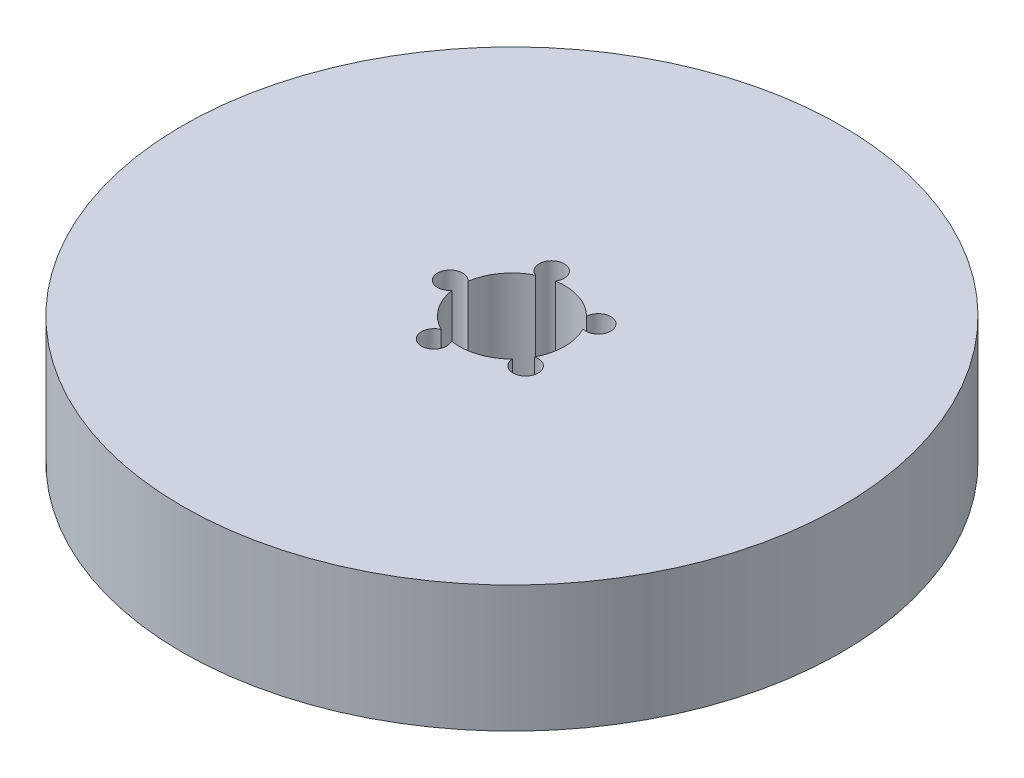
ISO-10303-21;
HEADER;
FILE_DESCRIPTION(('STEP AP214'),'2;1');
FILE_NAME('part.step','',(''),(''),'','','');
FILE_SCHEMA(('AUTOMOTIVE_DESIGN { 1 0 10303 214 1 1 1 1 }'));
ENDSEC;
DATA;
#1=APPLICATION_CONTEXT('core data for automotive mechanical design processes');
#2=APPLICATION_PROTOCOL_DEFINITION('international standard','automotive_design',2000,#1);
#3=PRODUCT_CONTEXT('',#1,'mechanical');
#4=PRODUCT('Part','Part','',(#3));
#5=PRODUCT_RELATED_PRODUCT_CATEGORY('part','',(#4));
#6=PRODUCT_DEFINITION_FORMATION('','',#4);
#7=PRODUCT_DEFINITION_CONTEXT('part definition',#1,'design');
#8=PRODUCT_DEFINITION('design','',#6,#7);
#9=PRODUCT_DEFINITION_SHAPE('','',#8);
#10=(LENGTH_UNIT() NAMED_UNIT(*) SI_UNIT(.MILLI.,.METRE.));
#11=(NAMED_UNIT(*) PLANE_ANGLE_UNIT() SI_UNIT($,.RADIAN.));
#12=(NAMED_UNIT(*) SI_UNIT($,.STERADIAN.) SOLID_ANGLE_UNIT());
#13=UNCERTAINTY_MEASURE_WITH_UNIT(LENGTH_MEASURE(1.E-05),#10,'distance_accuracy_value','');
#14=(GEOMETRIC_REPRESENTATION_CONTEXT(3) GLOBAL_UNCERTAINTY_ASSIGNED_CONTEXT((#13)) GLOBAL_UNIT_ASSIGNED_CONTEXT((#10,
#11,#12)) REPRESENTATION_CONTEXT('',''));
#15=CARTESIAN_POINT('',(0.,0.,0.));
#16=DIRECTION('',(0.,0.,1.));
#17=DIRECTION('',(1.,0.,0.));
#18=AXIS2_PLACEMENT_3D('',#15,#16,#17);
#19=CARTESIAN_POINT('',(0.,24.,0.));
#20=DIRECTION('',(0.,-1.,0.));
#21=DIRECTION('',(0.,0.,-1.));
#22=AXIS2_PLACEMENT_3D('',#19,#20,#21);
#23=CYLINDRICAL_SURFACE('',#22,62.5);
#24=CARTESIAN_POINT('',(0.,24.,0.));
#25=DIRECTION('',(0.,1.,0.));
#26=DIRECTION('',(0.,0.,1.));
#27=AXIS2_PLACEMENT_3D('',#24,#25,#26);
#28=CIRCLE('',#27,62.5);
#29=CARTESIAN_POINT('',(0.,24.,62.5));
#30=VERTEX_POINT('',#29);
#31=EDGE_CURVE('E157',#30,#30,#28,.T.);
#32=ORIENTED_EDGE('',*,*,#31,.F.);
#33=EDGE_LOOP('',(#32));
#34=FACE_BOUND('',#33,.T.);
#35=CARTESIAN_POINT('',(0.,0.,0.));
#36=DIRECTION('',(0.,1.,0.));
#37=DIRECTION('',(0.,0.,1.));
#38=AXIS2_PLACEMENT_3D('',#35,#36,#37);
#39=CIRCLE('',#38,62.5);
#40=CARTESIAN_POINT('',(0.,0.,62.5));
#41=VERTEX_POINT('',#40);
#42=EDGE_CURVE('E150',#41,#41,#39,.T.);
#43=ORIENTED_EDGE('',*,*,#42,.T.);
#44=EDGE_LOOP('',(#43));
#45=FACE_BOUND('',#44,.T.);
#46=ADVANCED_FACE('F39',(#34,#45),#23,.T.);
#47=CARTESIAN_POINT('',(0.,24.,0.));
#48=DIRECTION('',(0.,1.,0.));
#49=DIRECTION('',(0.,0.,1.));
#50=AXIS2_PLACEMENT_3D('',#47,#48,#49);
#51=PLANE('',#50);
#52=CARTESIAN_POINT('',(-3.62283496314992,24.,-11.149939523989));
#53=DIRECTION('',(0.,1.,0.));
#54=DIRECTION('',(-0.95105651629515,0.,0.309016994374958));
#55=AXIS2_PLACEMENT_3D('',#52,#53,#54);
#56=CIRCLE('',#55,2.38429123214421);
#57=CARTESIAN_POINT('',(-1.61168399367624,24.,-9.86926920823055));
#58=VERTEX_POINT('',#57);
#59=CARTESIAN_POINT('',(-4.49713115105617,24.,-8.93173059435853));
#60=VERTEX_POINT('',#59);
#61=EDGE_CURVE('E194',#58,#60,#56,.T.);
#62=ORIENTED_EDGE('',*,*,#61,.F.);
#63=CARTESIAN_POINT('',(0.,24.,0.));
#64=DIRECTION('',(0.,1.,0.));
#65=DIRECTION('',(0.,0.,1.));
#66=AXIS2_PLACEMENT_3D('',#63,#64,#65);
#67=CIRCLE('',#66,10.);
#68=CARTESIAN_POINT('',(7.10489063194816,24.,-7.03708242868131));
#69=VERTEX_POINT('',#68);
#70=EDGE_CURVE('E147',#69,#58,#67,.T.);
#71=ORIENTED_EDGE('',*,*,#70,.F.);
#72=CARTESIAN_POINT('',(9.48470506915758,24.,-6.89104159833114));
#73=DIRECTION('',(0.,1.,0.));
#74=DIRECTION('',(-0.58778525229248,0.,-0.809016994374942));
#75=AXIS2_PLACEMENT_3D('',#72,#73,#74);
#76=CIRCLE('',#75,2.38429123214421);
#77=CARTESIAN_POINT('',(8.88819504795075,24.,-4.58257447179899));
#78=VERTEX_POINT('',#77);
#79=EDGE_CURVE('E254',#78,#69,#76,.T.);
#80=ORIENTED_EDGE('',*,*,#79,.F.);
#81=CARTESIAN_POINT('',(8.88819504795081,24.,4.58257447179886));
#82=VERTEX_POINT('',#81);
#83=EDGE_CURVE('E144',#82,#78,#67,.T.);
#84=ORIENTED_EDGE('',*,*,#83,.F.);
#85=CARTESIAN_POINT('',(9.48470506915768,24.,6.891041598331));
#86=DIRECTION('',(0.,1.,0.));
#87=DIRECTION('',(0.587785252292469,0.,-0.809016994374951));
#88=AXIS2_PLACEMENT_3D('',#85,#86,#87);
#89=CIRCLE('',#88,2.38429123214421);
#90=CARTESIAN_POINT('',(7.10489063194826,24.,7.03708242868121));
#91=VERTEX_POINT('',#90);
#92=EDGE_CURVE('E141',#91,#82,#89,.T.);
#93=ORIENTED_EDGE('',*,*,#92,.F.);
#94=CARTESIAN_POINT('',(-1.61168399367611,24.,9.86926920823058));
#95=VERTEX_POINT('',#94);
#96=EDGE_CURVE('E134',#95,#91,#67,.T.);
#97=ORIENTED_EDGE('',*,*,#96,.F.);
#98=CARTESIAN_POINT('',(-3.62283496314976,24.,11.1499395239891));
#99=DIRECTION('',(0.,1.,0.));
#100=DIRECTION('',(0.951056516295155,0.,0.309016994374945));
#101=AXIS2_PLACEMENT_3D('',#98,#99,#100);
#102=CIRCLE('',#101,2.38429123214421);
#103=CARTESIAN_POINT('',(-4.49713115105604,24.,8.9317305943586));
#104=VERTEX_POINT('',#103);
#105=EDGE_CURVE('E111',#104,#95,#102,.T.);
#106=ORIENTED_EDGE('',*,*,#105,.F.);
#107=CARTESIAN_POINT('',(-9.88427053516681,24.,1.51696934301035));
#108=VERTEX_POINT('',#107);
#109=EDGE_CURVE('E145',#108,#104,#67,.T.);
#110=ORIENTED_EDGE('',*,*,#109,.F.);
#111=CARTESIAN_POINT('',(-11.7237402120157,24.,0.));
#112=DIRECTION('',(0.,1.,0.));
#113=DIRECTION('',(0.,0.,1.));
#114=AXIS2_PLACEMENT_3D('',#111,#112,#113);
#115=CIRCLE('',#114,2.38429123214421);
#116=CARTESIAN_POINT('',(-9.88427053516681,24.,-1.51696934301035));
#117=VERTEX_POINT('',#116);
#118=EDGE_CURVE('E153',#117,#108,#115,.T.);
#119=ORIENTED_EDGE('',*,*,#118,.F.);
#120=EDGE_CURVE('E146',#60,#117,#67,.T.);
#121=ORIENTED_EDGE('',*,*,#120,.F.);
#122=EDGE_LOOP('',(#62,#71,#80,#84,#93,#97,#106,#110,#119,#121));
#123=FACE_BOUND('',#122,.T.);
#124=ORIENTED_EDGE('',*,*,#31,.T.);
#125=EDGE_LOOP('',(#124));
#126=FACE_BOUND('',#125,.T.);
#127=ADVANCED_FACE('F139',(#123,#126),#51,.T.);
#128=CARTESIAN_POINT('',(0.,0.,0.));
#129=DIRECTION('',(0.,1.,0.));
#130=DIRECTION('',(0.,0.,1.));
#131=AXIS2_PLACEMENT_3D('',#128,#129,#130);
#132=PLANE('',#131);
#133=CARTESIAN_POINT('',(0.,0.,0.));
#134=DIRECTION('',(0.,1.,0.));
#135=DIRECTION('',(0.,0.,1.));
#136=AXIS2_PLACEMENT_3D('',#133,#134,#135);
#137=CIRCLE('',#136,10.);
#138=CARTESIAN_POINT('',(0.,0.,10.));
#139=VERTEX_POINT('',#138);
#140=EDGE_CURVE('E154',#139,#139,#137,.T.);
#141=ORIENTED_EDGE('',*,*,#140,.T.);
#142=EDGE_LOOP('',(#141));
#143=FACE_BOUND('',#142,.T.);
#144=ORIENTED_EDGE('',*,*,#42,.F.);
#145=EDGE_LOOP('',(#144));
#146=FACE_BOUND('',#145,.T.);
#147=ADVANCED_FACE('F213',(#143,#146),#132,.F.);
#148=CARTESIAN_POINT('',(0.,24.,0.));
#149=DIRECTION('',(0.,-1.,0.));
#150=DIRECTION('',(0.,0.,-1.));
#151=AXIS2_PLACEMENT_3D('',#148,#149,#150);
#152=CYLINDRICAL_SURFACE('',#151,10.);
#153=DIRECTION('',(0.,1.,0.));
#154=VECTOR('',#153,1.);
#155=CARTESIAN_POINT('',(-1.61168399367624,12.0632224624725,-9.86926920823056));
#156=LINE('',#155,#154);
#157=CARTESIAN_POINT('',(-1.61168399367624,0.126444924944992,-9.86926920823055));
#158=VERTEX_POINT('',#157);
#159=EDGE_CURVE('E11',#158,#58,#156,.T.);
#160=ORIENTED_EDGE('',*,*,#159,.F.);
#161=CARTESIAN_POINT('',(0.,0.126444924944992,0.));
#162=DIRECTION('',(0.,1.,0.));
#163=DIRECTION('',(0.,0.,1.));
#164=AXIS2_PLACEMENT_3D('',#161,#162,#163);
#165=CIRCLE('',#164,10.);
#166=CARTESIAN_POINT('',(-4.49713115105617,0.126444924944992,-8.93173059435853));
#167=VERTEX_POINT('',#166);
#168=EDGE_CURVE('E189',#158,#167,#165,.T.);
#169=ORIENTED_EDGE('',*,*,#168,.T.);
#170=DIRECTION('',(0.,1.,0.));
#171=VECTOR('',#170,1.);
#172=CARTESIAN_POINT('',(-4.49713115105618,12.0632224624725,-8.93173059435853));
#173=LINE('',#172,#171);
#174=EDGE_CURVE('E46',#60,#167,#173,.F.);
#175=ORIENTED_EDGE('',*,*,#174,.F.);
#176=ORIENTED_EDGE('',*,*,#120,.T.);
#177=DIRECTION('',(0.,1.,0.));
#178=VECTOR('',#177,1.);
#179=CARTESIAN_POINT('',(-9.88427053516681,12.0632224624725,-1.51696934301035));
#180=LINE('',#179,#178);
#181=CARTESIAN_POINT('',(-9.88427053516681,0.126444924944992,-1.51696934301035));
#182=VERTEX_POINT('',#181);
#183=EDGE_CURVE('E168',#182,#117,#180,.T.);
#184=ORIENTED_EDGE('',*,*,#183,.F.);
#185=CARTESIAN_POINT('',(0.,0.126444924944992,0.));
#186=DIRECTION('',(0.,1.,0.));
#187=DIRECTION('',(0.,0.,1.));
#188=AXIS2_PLACEMENT_3D('',#185,#186,#187);
#189=CIRCLE('',#188,10.);
#190=CARTESIAN_POINT('',(-9.88427053516681,0.126444924944992,1.51696934301035));
#191=VERTEX_POINT('',#190);
#192=EDGE_CURVE('E165',#182,#191,#189,.T.);
#193=ORIENTED_EDGE('',*,*,#192,.T.);
#194=DIRECTION('',(0.,1.,0.));
#195=VECTOR('',#194,1.);
#196=CARTESIAN_POINT('',(-9.88427053516681,12.0632224624725,1.51696934301035));
#197=LINE('',#196,#195);
#198=EDGE_CURVE('E170',#108,#191,#197,.F.);
#199=ORIENTED_EDGE('',*,*,#198,.F.);
#200=ORIENTED_EDGE('',*,*,#109,.T.);
#201=DIRECTION('',(0.,1.,0.));
#202=VECTOR('',#201,1.);
#203=CARTESIAN_POINT('',(-4.49713115105604,12.0632224624725,8.9317305943586));
#204=LINE('',#203,#202);
#205=CARTESIAN_POINT('',(-4.49713115105604,0.126444924944992,8.9317305943586));
#206=VERTEX_POINT('',#205);
#207=EDGE_CURVE('E121',#206,#104,#204,.T.);
#208=ORIENTED_EDGE('',*,*,#207,.F.);
#209=CARTESIAN_POINT('',(0.,0.126444924944992,0.));
#210=DIRECTION('',(0.,1.,0.));
#211=DIRECTION('',(0.,0.,1.));
#212=AXIS2_PLACEMENT_3D('',#209,#210,#211);
#213=CIRCLE('',#212,10.);
#214=CARTESIAN_POINT('',(-1.61168399367611,0.126444924944992,9.86926920823058));
#215=VERTEX_POINT('',#214);
#216=EDGE_CURVE('E136',#206,#215,#213,.T.);
#217=ORIENTED_EDGE('',*,*,#216,.T.);
#218=DIRECTION('',(0.,1.,0.));
#219=VECTOR('',#218,1.);
#220=CARTESIAN_POINT('',(-1.61168399367611,12.0632224624725,9.86926920823058));
#221=LINE('',#220,#219);
#222=EDGE_CURVE('E117',#95,#215,#221,.F.);
#223=ORIENTED_EDGE('',*,*,#222,.F.);
#224=ORIENTED_EDGE('',*,*,#96,.T.);
#225=DIRECTION('',(0.,1.,0.));
#226=VECTOR('',#225,1.);
#227=CARTESIAN_POINT('',(7.10489063194826,12.0632224624725,7.03708242868122));
#228=LINE('',#227,#226);
#229=CARTESIAN_POINT('',(7.10489063194826,0.126444924944992,7.03708242868121));
#230=VERTEX_POINT('',#229);
#231=EDGE_CURVE('E182',#230,#91,#228,.T.);
#232=ORIENTED_EDGE('',*,*,#231,.F.);
#233=CARTESIAN_POINT('',(0.,0.126444924944992,0.));
#234=DIRECTION('',(0.,1.,0.));
#235=DIRECTION('',(0.,0.,1.));
#236=AXIS2_PLACEMENT_3D('',#233,#234,#235);
#237=CIRCLE('',#236,10.);
#238=CARTESIAN_POINT('',(8.88819504795081,0.126444924944992,4.58257447179886));
#239=VERTEX_POINT('',#238);
#240=EDGE_CURVE('E174',#230,#239,#237,.T.);
#241=ORIENTED_EDGE('',*,*,#240,.T.);
#242=DIRECTION('',(0.,1.,0.));
#243=VECTOR('',#242,1.);
#244=CARTESIAN_POINT('',(8.88819504795082,12.0632224624725,4.58257447179886));
#245=LINE('',#244,#243);
#246=EDGE_CURVE('E177',#82,#239,#245,.F.);
#247=ORIENTED_EDGE('',*,*,#246,.F.);
#248=ORIENTED_EDGE('',*,*,#83,.T.);
#249=DIRECTION('',(0.,1.,0.));
#250=VECTOR('',#249,1.);
#251=CARTESIAN_POINT('',(8.88819504795076,12.0632224624725,-4.58257447179899));
#252=LINE('',#251,#250);
#253=CARTESIAN_POINT('',(8.88819504795075,0.126444924944992,-4.58257447179899));
#254=VERTEX_POINT('',#253);
#255=EDGE_CURVE('E187',#254,#78,#252,.T.);
#256=ORIENTED_EDGE('',*,*,#255,.F.);
#257=CARTESIAN_POINT('',(0.,0.126444924944992,0.));
#258=DIRECTION('',(0.,1.,0.));
#259=DIRECTION('',(0.,0.,1.));
#260=AXIS2_PLACEMENT_3D('',#257,#258,#259);
#261=CIRCLE('',#260,10.);
#262=CARTESIAN_POINT('',(7.10489063194816,0.126444924944992,-7.03708242868131));
#263=VERTEX_POINT('',#262);
#264=EDGE_CURVE('E181',#254,#263,#261,.T.);
#265=ORIENTED_EDGE('',*,*,#264,.T.);
#266=DIRECTION('',(0.,1.,0.));
#267=VECTOR('',#266,1.);
#268=CARTESIAN_POINT('',(7.10489063194816,12.0632224624725,-7.03708242868132));
#269=LINE('',#268,#267);
#270=EDGE_CURVE('E186',#69,#263,#269,.F.);
#271=ORIENTED_EDGE('',*,*,#270,.F.);
#272=ORIENTED_EDGE('',*,*,#70,.T.);
#273=EDGE_LOOP('',(#160,#169,#175,#176,#184,#193,#199,#200,#208,#217,#223,#224,#232,#241,#247,
#248,#256,#265,#271,#272));
#274=FACE_BOUND('',#273,.T.);
#275=ORIENTED_EDGE('',*,*,#140,.F.);
#276=EDGE_LOOP('',(#275));
#277=FACE_BOUND('',#276,.T.);
#278=ADVANCED_FACE('F135',(#274,#277),#152,.F.);
#279=CARTESIAN_POINT('',(-11.7237402120157,0.126444924944992,0.));
#280=DIRECTION('',(0.,1.,0.));
#281=DIRECTION('',(0.,0.,1.));
#282=AXIS2_PLACEMENT_3D('',#279,#280,#281);
#283=CYLINDRICAL_SURFACE('',#282,2.38429123214421);
#284=ORIENTED_EDGE('',*,*,#183,.T.);
#285=ORIENTED_EDGE('',*,*,#118,.T.);
#286=ORIENTED_EDGE('',*,*,#198,.T.);
#287=CARTESIAN_POINT('',(-11.7237402120157,0.126444924944992,0.));
#288=DIRECTION('',(0.,1.,0.));
#289=DIRECTION('',(0.,0.,1.));
#290=AXIS2_PLACEMENT_3D('',#287,#288,#289);
#291=CIRCLE('',#290,2.38429123214421);
#292=EDGE_CURVE('E158',#182,#191,#291,.T.);
#293=ORIENTED_EDGE('',*,*,#292,.F.);
#294=EDGE_LOOP('',(#284,#285,#286,#293));
#295=FACE_BOUND('',#294,.T.);
#296=ADVANCED_FACE('F221',(#295),#283,.F.);
#297=CARTESIAN_POINT('',(-11.7237402120157,0.126444924944992,0.));
#298=DIRECTION('',(0.,1.,0.));
#299=DIRECTION('',(0.,0.,1.));
#300=AXIS2_PLACEMENT_3D('',#297,#298,#299);
#301=PLANE('',#300);
#302=ORIENTED_EDGE('',*,*,#292,.T.);
#303=ORIENTED_EDGE('',*,*,#192,.F.);
#304=EDGE_LOOP('',(#302,#303));
#305=FACE_BOUND('',#304,.T.);
#306=ADVANCED_FACE('F227',(#305),#301,.T.);
#307=CARTESIAN_POINT('',(-3.62283496314976,0.126444924944992,11.1499395239891));
#308=DIRECTION('',(0.,1.,0.));
#309=DIRECTION('',(0.,0.,1.));
#310=AXIS2_PLACEMENT_3D('',#307,#308,#309);
#311=CYLINDRICAL_SURFACE('',#310,2.38429123214421);
#312=ORIENTED_EDGE('',*,*,#207,.T.);
#313=ORIENTED_EDGE('',*,*,#105,.T.);
#314=ORIENTED_EDGE('',*,*,#222,.T.);
#315=CARTESIAN_POINT('',(-3.62283496314976,0.126444924944992,11.1499395239891));
#316=DIRECTION('',(0.,1.,0.));
#317=DIRECTION('',(0.951056516295155,0.,0.309016994374945));
#318=AXIS2_PLACEMENT_3D('',#315,#316,#317);
#319=CIRCLE('',#318,2.38429123214421);
#320=EDGE_CURVE('E127',#206,#215,#319,.T.);
#321=ORIENTED_EDGE('',*,*,#320,.F.);
#322=EDGE_LOOP('',(#312,#313,#314,#321));
#323=FACE_BOUND('',#322,.T.);
#324=ADVANCED_FACE('F116',(#323),#311,.F.);
#325=CARTESIAN_POINT('',(-3.62283496314976,0.126444924944992,11.1499395239891));
#326=DIRECTION('',(0.,1.,0.));
#327=DIRECTION('',(0.951056516295155,0.,0.309016994374945));
#328=AXIS2_PLACEMENT_3D('',#325,#326,#327);
#329=PLANE('',#328);
#330=ORIENTED_EDGE('',*,*,#320,.T.);
#331=ORIENTED_EDGE('',*,*,#216,.F.);
#332=EDGE_LOOP('',(#330,#331));
#333=FACE_BOUND('',#332,.T.);
#334=ADVANCED_FACE('F234',(#333),#329,.T.);
#335=CARTESIAN_POINT('',(9.48470506915768,0.126444924944992,6.891041598331));
#336=DIRECTION('',(0.,1.,0.));
#337=DIRECTION('',(0.,0.,1.));
#338=AXIS2_PLACEMENT_3D('',#335,#336,#337);
#339=CYLINDRICAL_SURFACE('',#338,2.38429123214421);
#340=ORIENTED_EDGE('',*,*,#231,.T.);
#341=ORIENTED_EDGE('',*,*,#92,.T.);
#342=ORIENTED_EDGE('',*,*,#246,.T.);
#343=CARTESIAN_POINT('',(9.48470506915768,0.126444924944992,6.891041598331));
#344=DIRECTION('',(0.,1.,0.));
#345=DIRECTION('',(0.587785252292469,0.,-0.809016994374951));
#346=AXIS2_PLACEMENT_3D('',#343,#344,#345);
#347=CIRCLE('',#346,2.38429123214421);
#348=EDGE_CURVE('E130',#230,#239,#347,.T.);
#349=ORIENTED_EDGE('',*,*,#348,.F.);
#350=EDGE_LOOP('',(#340,#341,#342,#349));
#351=FACE_BOUND('',#350,.T.);
#352=ADVANCED_FACE('F240',(#351),#339,.F.);
#353=CARTESIAN_POINT('',(9.48470506915768,0.126444924944992,6.891041598331));
#354=DIRECTION('',(0.,1.,0.));
#355=DIRECTION('',(0.587785252292469,0.,-0.809016994374951));
#356=AXIS2_PLACEMENT_3D('',#353,#354,#355);
#357=PLANE('',#356);
#358=ORIENTED_EDGE('',*,*,#348,.T.);
#359=ORIENTED_EDGE('',*,*,#240,.F.);
#360=EDGE_LOOP('',(#358,#359));
#361=FACE_BOUND('',#360,.T.);
#362=ADVANCED_FACE('F245',(#361),#357,.T.);
#363=CARTESIAN_POINT('',(9.48470506915758,0.126444924944992,-6.89104159833114));
#364=DIRECTION('',(0.,1.,0.));
#365=DIRECTION('',(0.,0.,1.));
#366=AXIS2_PLACEMENT_3D('',#363,#364,#365);
#367=CYLINDRICAL_SURFACE('',#366,2.38429123214421);
#368=ORIENTED_EDGE('',*,*,#255,.T.);
#369=ORIENTED_EDGE('',*,*,#79,.T.);
#370=ORIENTED_EDGE('',*,*,#270,.T.);
#371=CARTESIAN_POINT('',(9.48470506915758,0.126444924944992,-6.89104159833114));
#372=DIRECTION('',(0.,1.,0.));
#373=DIRECTION('',(-0.58778525229248,0.,-0.809016994374942));
#374=AXIS2_PLACEMENT_3D('',#371,#372,#373);
#375=CIRCLE('',#374,2.38429123214421);
#376=EDGE_CURVE('E56',#254,#263,#375,.T.);
#377=ORIENTED_EDGE('',*,*,#376,.F.);
#378=EDGE_LOOP('',(#368,#369,#370,#377));
#379=FACE_BOUND('',#378,.T.);
#380=ADVANCED_FACE('F266',(#379),#367,.F.);
#381=CARTESIAN_POINT('',(9.48470506915758,0.126444924944992,-6.89104159833114));
#382=DIRECTION('',(0.,1.,0.));
#383=DIRECTION('',(-0.58778525229248,0.,-0.809016994374942));
#384=AXIS2_PLACEMENT_3D('',#381,#382,#383);
#385=PLANE('',#384);
#386=ORIENTED_EDGE('',*,*,#376,.T.);
#387=ORIENTED_EDGE('',*,*,#264,.F.);
#388=EDGE_LOOP('',(#386,#387));
#389=FACE_BOUND('',#388,.T.);
#390=ADVANCED_FACE('F204',(#389),#385,.T.);
#391=CARTESIAN_POINT('',(-3.62283496314992,0.126444924944992,-11.149939523989));
#392=DIRECTION('',(0.,1.,0.));
#393=DIRECTION('',(0.,0.,1.));
#394=AXIS2_PLACEMENT_3D('',#391,#392,#393);
#395=CYLINDRICAL_SURFACE('',#394,2.38429123214421);
#396=ORIENTED_EDGE('',*,*,#159,.T.);
#397=ORIENTED_EDGE('',*,*,#61,.T.);
#398=ORIENTED_EDGE('',*,*,#174,.T.);
#399=CARTESIAN_POINT('',(-3.62283496314992,0.126444924944992,-11.149939523989));
#400=DIRECTION('',(0.,1.,0.));
#401=DIRECTION('',(-0.95105651629515,0.,0.309016994374958));
#402=AXIS2_PLACEMENT_3D('',#399,#400,#401);
#403=CIRCLE('',#402,2.38429123214421);
#404=EDGE_CURVE('E55',#158,#167,#403,.T.);
#405=ORIENTED_EDGE('',*,*,#404,.F.);
#406=EDGE_LOOP('',(#396,#397,#398,#405));
#407=FACE_BOUND('',#406,.T.);
#408=ADVANCED_FACE('F193',(#407),#395,.F.);
#409=CARTESIAN_POINT('',(-3.62283496314992,0.126444924944992,-11.149939523989));
#410=DIRECTION('',(0.,1.,0.));
#411=DIRECTION('',(-0.95105651629515,0.,0.309016994374958));
#412=AXIS2_PLACEMENT_3D('',#409,#410,#411);
#413=PLANE('',#412);
#414=ORIENTED_EDGE('',*,*,#404,.T.);
#415=ORIENTED_EDGE('',*,*,#168,.F.);
#416=EDGE_LOOP('',(#414,#415));
#417=FACE_BOUND('',#416,.T.);
#418=ADVANCED_FACE('F196',(#417),#413,.T.);
#419=CLOSED_SHELL('',(#46,#127,#147,#278,#296,#306,#324,#334,#352,#362,#380,#390,#408,#418));
#420=MANIFOLD_SOLID_BREP('B2',#419);
#421=ADVANCED_BREP_SHAPE_REPRESENTATION('',(#18,#420),#14);
#422=SHAPE_DEFINITION_REPRESENTATION(#9,#421);
ENDSEC;
END-ISO-10303-21;
